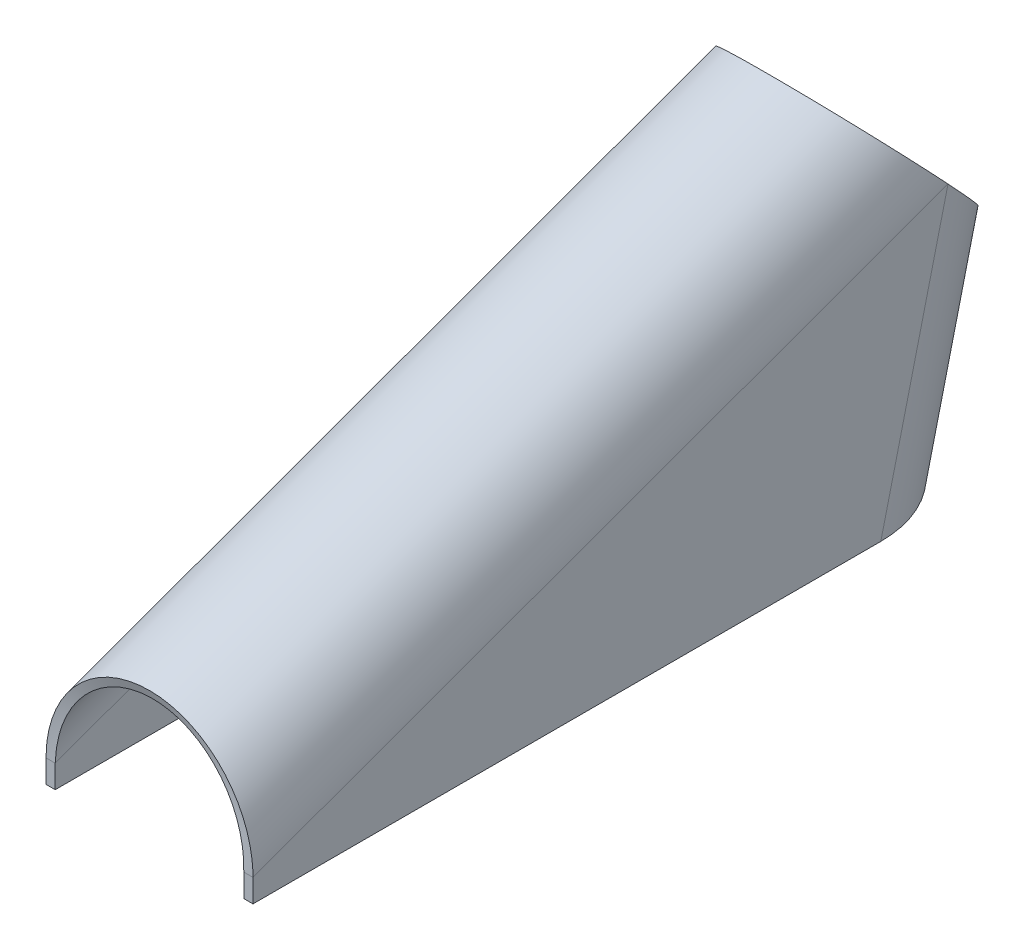
ISO-10303-21;
HEADER;
FILE_DESCRIPTION(('STEP AP214'),'2;1');
FILE_NAME('part.step','',(''),(''),'','','');
FILE_SCHEMA(('AUTOMOTIVE_DESIGN { 1 0 10303 214 1 1 1 1 }'));
ENDSEC;
DATA;
#1=APPLICATION_CONTEXT('core data for automotive mechanical design processes');
#2=APPLICATION_PROTOCOL_DEFINITION('international standard','automotive_design',2000,#1);
#3=PRODUCT_CONTEXT('',#1,'mechanical');
#4=PRODUCT('Part','Part','',(#3));
#5=PRODUCT_RELATED_PRODUCT_CATEGORY('part','',(#4));
#6=PRODUCT_DEFINITION_FORMATION('','',#4);
#7=PRODUCT_DEFINITION_CONTEXT('part definition',#1,'design');
#8=PRODUCT_DEFINITION('design','',#6,#7);
#9=PRODUCT_DEFINITION_SHAPE('','',#8);
#10=(LENGTH_UNIT() NAMED_UNIT(*) SI_UNIT(.MILLI.,.METRE.));
#11=(NAMED_UNIT(*) PLANE_ANGLE_UNIT() SI_UNIT($,.RADIAN.));
#12=(NAMED_UNIT(*) SI_UNIT($,.STERADIAN.) SOLID_ANGLE_UNIT());
#13=UNCERTAINTY_MEASURE_WITH_UNIT(LENGTH_MEASURE(1.E-05),#10,'distance_accuracy_value','');
#14=(GEOMETRIC_REPRESENTATION_CONTEXT(3) GLOBAL_UNCERTAINTY_ASSIGNED_CONTEXT((#13)) GLOBAL_UNIT_ASSIGNED_CONTEXT((#10,
#11,#12)) REPRESENTATION_CONTEXT('',''));
#15=CARTESIAN_POINT('',(0.,0.,0.));
#16=DIRECTION('',(0.,0.,1.));
#17=DIRECTION('',(1.,0.,0.));
#18=AXIS2_PLACEMENT_3D('',#15,#16,#17);
#19=CARTESIAN_POINT('',(0.,0.,-273.));
#20=DIRECTION('',(0.,-0.971605599894493,0.236606336038707));
#21=DIRECTION('',(0.00872653549837691,-0.236597326794433,-0.971568604130416));
#22=AXIS2_PLACEMENT_3D('',#19,#20,#21);
#23=CYLINDRICAL_SURFACE('',#22,45.);
#24=DIRECTION('',(0.,-0.971605599894494,0.236606336038707));
#25=VECTOR('',#24,1.);
#26=CARTESIAN_POINT('',(0.392694097426894,-73.4063149166926,-301.437348782619));
#27=LINE('',#26,#25);
#28=CARTESIAN_POINT('',(0.392694097426988,80.7136572999538,-338.968793579281));
#29=VERTEX_POINT('',#28);
#30=CARTESIAN_POINT('',(0.392694097426989,0.,-319.313325636219));
#31=VERTEX_POINT('',#30);
#32=EDGE_CURVE('E221',#29,#31,#27,.T.);
#33=ORIENTED_EDGE('',*,*,#32,.F.);
#34=CARTESIAN_POINT('',(0.,120.,-302.222516140014));
#35=DIRECTION('',(0.,-0.683102972547208,0.730322072032038));
#36=DIRECTION('',(0.,-0.730322072032038,-0.683102972547208));
#37=AXIS2_PLACEMENT_3D('',#34,#35,#36);
#38=ELLIPSE('',#37,53.795222909317,45.);
#39=CARTESIAN_POINT('',(45.0000000000001,120.,-302.222516140014));
#40=VERTEX_POINT('',#39);
#41=EDGE_CURVE('E407',#40,#29,#38,.F.);
#42=ORIENTED_EDGE('',*,*,#41,.F.);
#43=DIRECTION('',(0.,0.971605599894494,-0.236606336038707));
#44=VECTOR('',#43,1.);
#45=CARTESIAN_POINT('',(45.,123.708428844786,-303.125596321438));
#46=LINE('',#45,#44);
#47=CARTESIAN_POINT('',(45.0000000000001,0.,-273.));
#48=VERTEX_POINT('',#47);
#49=EDGE_CURVE('E261',#48,#40,#46,.T.);
#50=ORIENTED_EDGE('',*,*,#49,.F.);
#51=CARTESIAN_POINT('',(0.,0.,-273.));
#52=DIRECTION('',(0.,-1.,0.));
#53=DIRECTION('',(0.,0.,1.));
#54=AXIS2_PLACEMENT_3D('',#51,#52,#53);
#55=ELLIPSE('',#54,46.3150891728975,45.);
#56=EDGE_CURVE('E341',#48,#31,#55,.F.);
#57=ORIENTED_EDGE('',*,*,#56,.T.);
#58=EDGE_LOOP('',(#33,#42,#50,#57));
#59=FACE_BOUND('',#58,.T.);
#60=ADVANCED_FACE('F79',(#59),#23,.T.);
#61=CARTESIAN_POINT('',(0.,0.,-273.));
#62=DIRECTION('',(0.,-0.971605599894493,0.236606336038707));
#63=DIRECTION('',(0.00872653549837691,-0.236597326794433,-0.971568604130416));
#64=AXIS2_PLACEMENT_3D('',#61,#62,#63);
#65=CYLINDRICAL_SURFACE('',#64,41.);
#66=CARTESIAN_POINT('',(0.,120.,-302.222516140014));
#67=DIRECTION('',(0.,-0.650759245116275,0.759284139763038));
#68=DIRECTION('',(0.,-0.759284139763037,-0.650759245116275));
#69=AXIS2_PLACEMENT_3D('',#66,#67,#68);
#70=ELLIPSE('',#69,50.4967920551702,41.);
#71=CARTESIAN_POINT('',(41.,120.,-302.222516140014));
#72=VERTEX_POINT('',#71);
#73=CARTESIAN_POINT('',(0.357787955433481,81.6600466071315,-335.08251916276));
#74=VERTEX_POINT('',#73);
#75=EDGE_CURVE('E408',#72,#74,#70,.F.);
#76=ORIENTED_EDGE('',*,*,#75,.T.);
#77=DIRECTION('',(0.,0.971605599894494,-0.236606336038707));
#78=VECTOR('',#77,1.);
#79=CARTESIAN_POINT('',(0.357787955433481,110.299509601428,-342.056828909361));
#80=LINE('',#79,#78);
#81=CARTESIAN_POINT('',(0.357787955433476,0.946389307177714,-315.427051219697));
#82=VERTEX_POINT('',#81);
#83=EDGE_CURVE('E228',#74,#82,#80,.F.);
#84=ORIENTED_EDGE('',*,*,#83,.T.);
#85=CARTESIAN_POINT('',(0.,0.,-273.));
#86=DIRECTION('',(0.,-0.999751307936825,-0.0223007237238562));
#87=DIRECTION('',(0.,-0.0223007237238562,0.999751307936825));
#88=AXIS2_PLACEMENT_3D('',#85,#86,#87);
#89=ELLIPSE('',#88,42.4392210707671,41.);
#90=CARTESIAN_POINT('',(41.,0.,-273.));
#91=VERTEX_POINT('',#90);
#92=EDGE_CURVE('E338',#91,#82,#89,.F.);
#93=ORIENTED_EDGE('',*,*,#92,.F.);
#94=DIRECTION('',(0.,0.971605599894494,-0.236606336038707));
#95=VECTOR('',#94,1.);
#96=CARTESIAN_POINT('',(41.,123.708428844786,-303.125596321438));
#97=LINE('',#96,#95);
#98=EDGE_CURVE('E271',#91,#72,#97,.T.);
#99=ORIENTED_EDGE('',*,*,#98,.T.);
#100=EDGE_LOOP('',(#76,#84,#93,#99));
#101=FACE_BOUND('',#100,.T.);
#102=ADVANCED_FACE('F344',(#101),#65,.F.);
#103=CARTESIAN_POINT('',(2.35263921155085,-73.4022679588851,-301.420730263715));
#104=DIRECTION('',(0.00872653549837691,-0.236597326794433,-0.971568604130416));
#105=DIRECTION('',(0.,0.971605599894494,-0.236606336038707));
#106=AXIS2_PLACEMENT_3D('',#103,#104,#105);
#107=PLANE('',#106);
#108=DIRECTION('',(0.,-0.971605599894494,0.236606336038707));
#109=VECTOR('',#108,1.);
#110=CARTESIAN_POINT('',(0.201705846725105,-10.6472740644418,-316.722206589306));
#111=LINE('',#110,#109);
#112=CARTESIAN_POINT('',(0.201705846725119,80.7122021402106,-338.97015465542));
#113=VERTEX_POINT('',#112);
#114=CARTESIAN_POINT('',(0.201705846725106,0.,-319.315041074267));
#115=VERTEX_POINT('',#114);
#116=EDGE_CURVE('E209',#113,#115,#111,.T.);
#117=ORIENTED_EDGE('',*,*,#116,.F.);
#118=DIRECTION('',(-0.999945585612641,-0.00761869149490946,-0.00712610368273859));
#119=VECTOR('',#118,1.);
#120=CARTESIAN_POINT('',(1.44588495375754,80.7216816728148,-338.961288023631));
#121=LINE('',#120,#119);
#122=EDGE_CURVE('E196',#29,#113,#121,.T.);
#123=ORIENTED_EDGE('',*,*,#122,.F.);
#124=ORIENTED_EDGE('',*,*,#32,.T.);
#125=DIRECTION('',(-0.999959665144756,0.,-0.00898154127020295));
#126=VECTOR('',#125,1.);
#127=CARTESIAN_POINT('',(2.51317770836812,0.,-319.294279656938));
#128=LINE('',#127,#126);
#129=EDGE_CURVE('E215',#31,#115,#128,.T.);
#130=ORIENTED_EDGE('',*,*,#129,.T.);
#131=EDGE_LOOP('',(#117,#123,#124,#130));
#132=FACE_BOUND('',#131,.T.);
#133=ADVANCED_FACE('F213',(#132),#107,.T.);
#134=CARTESIAN_POINT('',(2.31773306955734,-72.4558786517074,-297.534455847193));
#135=DIRECTION('',(0.00872653549837691,-0.236597326794433,-0.971568604130416));
#136=DIRECTION('',(0.,0.971605599894494,-0.236606336038707));
#137=AXIS2_PLACEMENT_3D('',#134,#135,#136);
#138=PLANE('',#137);
#139=DIRECTION('',(-0.999945585612641,-0.00761869149490946,-0.00712610368273859));
#140=VECTOR('',#139,1.);
#141=CARTESIAN_POINT('',(1.41097881176403,81.6680709799925,-335.075013607109));
#142=LINE('',#141,#140);
#143=CARTESIAN_POINT('',(0.166799704731608,81.6585914473884,-335.083880238898));
#144=VERTEX_POINT('',#143);
#145=EDGE_CURVE('E414',#74,#144,#142,.T.);
#146=ORIENTED_EDGE('',*,*,#145,.T.);
#147=DIRECTION('',(0.,0.971605599894494,-0.236606336038707));
#148=VECTOR('',#147,1.);
#149=CARTESIAN_POINT('',(0.166799704731588,-72.4603199682072,-297.552693769535));
#150=LINE('',#149,#148);
#151=CARTESIAN_POINT('',(0.166799704731596,0.946389307177761,-315.428766657745));
#152=VERTEX_POINT('',#151);
#153=EDGE_CURVE('E96',#144,#152,#150,.F.);
#154=ORIENTED_EDGE('',*,*,#153,.T.);
#155=DIRECTION('',(-0.999959665144756,0.,-0.00898154127020295));
#156=VECTOR('',#155,1.);
#157=CARTESIAN_POINT('',(2.47827156637461,0.94638930717772,-315.408005240416));
#158=LINE('',#157,#156);
#159=EDGE_CURVE('E347',#82,#152,#158,.T.);
#160=ORIENTED_EDGE('',*,*,#159,.F.);
#161=ORIENTED_EDGE('',*,*,#83,.F.);
#162=EDGE_LOOP('',(#146,#154,#160,#161));
#163=FACE_BOUND('',#162,.T.);
#164=ADVANCED_FACE('F621',(#163),#138,.F.);
#165=CARTESIAN_POINT('',(0.201705846725105,-10.6472740644418,-316.722206589306));
#166=DIRECTION('',(-0.999961923064171,-0.00206475359058271,-0.00847875075790174));
#167=DIRECTION('',(-0.00847876883129597,0.,0.999964054593517));
#168=AXIS2_PLACEMENT_3D('',#165,#166,#167);
#169=PLANE('',#168);
#170=ORIENTED_EDGE('',*,*,#153,.F.);
#171=DIRECTION('',(0.00872653549837691,-0.236597326794433,-0.971568604130416));
#172=VECTOR('',#171,1.);
#173=CARTESIAN_POINT('',(0.201705846725119,80.7122021402106,-338.97015465542));
#174=LINE('',#173,#172);
#175=EDGE_CURVE('E199',#113,#144,#174,.F.);
#176=ORIENTED_EDGE('',*,*,#175,.F.);
#177=ORIENTED_EDGE('',*,*,#116,.T.);
#178=DIRECTION('',(0.00872653549837691,-0.236597326794433,-0.971568604130416));
#179=VECTOR('',#178,1.);
#180=CARTESIAN_POINT('',(0.201705846725106,0.,-319.315041074267));
#181=LINE('',#180,#179);
#182=EDGE_CURVE('E355',#115,#152,#181,.F.);
#183=ORIENTED_EDGE('',*,*,#182,.T.);
#184=EDGE_LOOP('',(#170,#176,#177,#183));
#185=FACE_BOUND('',#184,.T.);
#186=ADVANCED_FACE('F207',(#185),#169,.T.);
#187=CARTESIAN_POINT('',(0.,120.,-302.222516140014));
#188=DIRECTION('',(0.,0.971605599894494,-0.236606336038707));
#189=DIRECTION('',(-0.00872653549837747,-0.236597326794433,-0.971568604130416));
#190=AXIS2_PLACEMENT_3D('',#187,#188,#189);
#191=CYLINDRICAL_SURFACE('',#190,45.);
#192=DIRECTION('',(0.,0.971605599894494,-0.236606336038707));
#193=VECTOR('',#192,1.);
#194=CARTESIAN_POINT('',(-0.392694097426992,-73.4063149166926,-301.437348782619));
#195=LINE('',#194,#193);
#196=CARTESIAN_POINT('',(-0.39269409742699,0.,-319.313325636219));
#197=VERTEX_POINT('',#196);
#198=CARTESIAN_POINT('',(-0.392694097426989,80.7136572999538,-338.968793579281));
#199=VERTEX_POINT('',#198);
#200=EDGE_CURVE('E360',#197,#199,#195,.T.);
#201=ORIENTED_EDGE('',*,*,#200,.F.);
#202=CARTESIAN_POINT('',(0.,0.,-273.));
#203=DIRECTION('',(0.,-1.,0.));
#204=DIRECTION('',(0.,0.,-1.));
#205=AXIS2_PLACEMENT_3D('',#202,#203,#204);
#206=ELLIPSE('',#205,46.3150891728974,45.);
#207=CARTESIAN_POINT('',(-45.,0.,-273.));
#208=VERTEX_POINT('',#207);
#209=EDGE_CURVE('E410',#197,#208,#206,.F.);
#210=ORIENTED_EDGE('',*,*,#209,.T.);
#211=DIRECTION('',(0.,-0.971605599894494,0.236606336038707));
#212=VECTOR('',#211,1.);
#213=CARTESIAN_POINT('',(-45.,123.708428844786,-303.125596321438));
#214=LINE('',#213,#212);
#215=CARTESIAN_POINT('',(-45.,120.,-302.222516140014));
#216=VERTEX_POINT('',#215);
#217=EDGE_CURVE('E238',#216,#208,#214,.T.);
#218=ORIENTED_EDGE('',*,*,#217,.F.);
#219=CARTESIAN_POINT('',(0.,120.,-302.222516140014));
#220=DIRECTION('',(0.,-0.683102972547208,0.730322072032038));
#221=DIRECTION('',(0.,0.730322072032038,0.683102972547208));
#222=AXIS2_PLACEMENT_3D('',#219,#220,#221);
#223=ELLIPSE('',#222,53.7952229093169,45.);
#224=EDGE_CURVE('E383',#199,#216,#223,.F.);
#225=ORIENTED_EDGE('',*,*,#224,.F.);
#226=EDGE_LOOP('',(#201,#210,#218,#225));
#227=FACE_BOUND('',#226,.T.);
#228=ADVANCED_FACE('F434',(#227),#191,.T.);
#229=CARTESIAN_POINT('',(0.,120.,-302.222516140014));
#230=DIRECTION('',(0.,0.971605599894494,-0.236606336038707));
#231=DIRECTION('',(-0.00872653549837747,-0.236597326794433,-0.971568604130416));
#232=AXIS2_PLACEMENT_3D('',#229,#230,#231);
#233=CYLINDRICAL_SURFACE('',#232,41.);
#234=CARTESIAN_POINT('',(0.,0.,-273.));
#235=DIRECTION('',(0.,-0.999751307936825,-0.0223007237238562));
#236=DIRECTION('',(0.,0.0223007237238562,-0.999751307936825));
#237=AXIS2_PLACEMENT_3D('',#234,#235,#236);
#238=ELLIPSE('',#237,42.4392210707671,41.);
#239=CARTESIAN_POINT('',(-0.35778795543348,0.946389307177695,-315.427051219697));
#240=VERTEX_POINT('',#239);
#241=CARTESIAN_POINT('',(-41.,0.,-273.));
#242=VERTEX_POINT('',#241);
#243=EDGE_CURVE('E373',#240,#242,#238,.F.);
#244=ORIENTED_EDGE('',*,*,#243,.F.);
#245=DIRECTION('',(0.,-0.971605599894494,0.236606336038707));
#246=VECTOR('',#245,1.);
#247=CARTESIAN_POINT('',(-0.357787955433479,-9.70049039857174,-312.834312769347));
#248=LINE('',#247,#246);
#249=CARTESIAN_POINT('',(-0.357787955433478,81.6600466071315,-335.08251916276));
#250=VERTEX_POINT('',#249);
#251=EDGE_CURVE('E224',#240,#250,#248,.F.);
#252=ORIENTED_EDGE('',*,*,#251,.T.);
#253=CARTESIAN_POINT('',(0.,120.,-302.222516140014));
#254=DIRECTION('',(0.,-0.650759245116276,0.759284139763037));
#255=DIRECTION('',(0.,0.759284139763037,0.650759245116275));
#256=AXIS2_PLACEMENT_3D('',#253,#254,#255);
#257=ELLIPSE('',#256,50.4967920551701,41.);
#258=CARTESIAN_POINT('',(-41.,120.,-302.222516140014));
#259=VERTEX_POINT('',#258);
#260=EDGE_CURVE('E372',#250,#259,#257,.F.);
#261=ORIENTED_EDGE('',*,*,#260,.T.);
#262=DIRECTION('',(0.,-0.971605599894494,0.236606336038707));
#263=VECTOR('',#262,1.);
#264=CARTESIAN_POINT('',(-41.,123.708428844786,-303.125596321438));
#265=LINE('',#264,#263);
#266=EDGE_CURVE('E237',#259,#242,#265,.T.);
#267=ORIENTED_EDGE('',*,*,#266,.T.);
#268=EDGE_LOOP('',(#244,#252,#261,#267));
#269=FACE_BOUND('',#268,.T.);
#270=ADVANCED_FACE('F371',(#269),#233,.F.);
#271=CARTESIAN_POINT('',(-2.35263921155099,-73.4022679588851,-301.420730263715));
#272=DIRECTION('',(-0.00872653549837747,-0.236597326794433,-0.971568604130415));
#273=DIRECTION('',(0.,0.971605599894493,-0.236606336038707));
#274=AXIS2_PLACEMENT_3D('',#271,#272,#273);
#275=PLANE('',#274);
#276=DIRECTION('',(0.,0.971605599894494,-0.236606336038707));
#277=VECTOR('',#276,1.);
#278=CARTESIAN_POINT('',(-0.201705846725125,109.352725935558,-345.94472272932));
#279=LINE('',#278,#277);
#280=CARTESIAN_POINT('',(-0.201705846725126,0.,-319.315041074267));
#281=VERTEX_POINT('',#280);
#282=CARTESIAN_POINT('',(-0.201705846725125,80.712202140211,-338.97015465542));
#283=VERTEX_POINT('',#282);
#284=EDGE_CURVE('E230',#281,#283,#279,.T.);
#285=ORIENTED_EDGE('',*,*,#284,.F.);
#286=DIRECTION('',(-0.999959665144755,0.,0.00898154127020353));
#287=VECTOR('',#286,1.);
#288=CARTESIAN_POINT('',(-2.51317770836828,0.,-319.294279656938));
#289=LINE('',#288,#287);
#290=EDGE_CURVE('E418',#281,#197,#289,.T.);
#291=ORIENTED_EDGE('',*,*,#290,.T.);
#292=ORIENTED_EDGE('',*,*,#200,.T.);
#293=DIRECTION('',(-0.999945585612641,0.00761869149490995,0.00712610368273905));
#294=VECTOR('',#293,1.);
#295=CARTESIAN_POINT('',(-1.44588495375763,80.7216816728148,-338.961288023631));
#296=LINE('',#295,#294);
#297=EDGE_CURVE('E391',#283,#199,#296,.T.);
#298=ORIENTED_EDGE('',*,*,#297,.F.);
#299=EDGE_LOOP('',(#285,#291,#292,#298));
#300=FACE_BOUND('',#299,.T.);
#301=ADVANCED_FACE('F432',(#300),#275,.T.);
#302=CARTESIAN_POINT('',(-2.31773306955748,-72.4558786517074,-297.534455847193));
#303=DIRECTION('',(-0.00872653549837747,-0.236597326794433,-0.971568604130415));
#304=DIRECTION('',(0.,0.971605599894493,-0.236606336038707));
#305=AXIS2_PLACEMENT_3D('',#302,#303,#304);
#306=PLANE('',#305);
#307=DIRECTION('',(-0.999959665144755,0.,0.00898154127020353));
#308=VECTOR('',#307,1.);
#309=CARTESIAN_POINT('',(-2.47827156637477,0.946389307177733,-315.408005240416));
#310=LINE('',#309,#308);
#311=CARTESIAN_POINT('',(-0.166799704731617,0.94638930717773,-315.428766657745));
#312=VERTEX_POINT('',#311);
#313=EDGE_CURVE('E420',#312,#240,#310,.T.);
#314=ORIENTED_EDGE('',*,*,#313,.F.);
#315=DIRECTION('',(0.,-0.971605599894494,0.236606336038707));
#316=VECTOR('',#315,1.);
#317=CARTESIAN_POINT('',(-0.166799704731615,-72.4603199682072,-297.552693769535));
#318=LINE('',#317,#316);
#319=CARTESIAN_POINT('',(-0.166799704731617,81.6585914473887,-335.083880238898));
#320=VERTEX_POINT('',#319);
#321=EDGE_CURVE('E359',#312,#320,#318,.F.);
#322=ORIENTED_EDGE('',*,*,#321,.T.);
#323=DIRECTION('',(-0.999945585612641,0.00761869149490995,0.00712610368273905));
#324=VECTOR('',#323,1.);
#325=CARTESIAN_POINT('',(-1.41097881176412,81.6680709799925,-335.075013607109));
#326=LINE('',#325,#324);
#327=EDGE_CURVE('E389',#320,#250,#326,.T.);
#328=ORIENTED_EDGE('',*,*,#327,.T.);
#329=ORIENTED_EDGE('',*,*,#251,.F.);
#330=EDGE_LOOP('',(#314,#322,#328,#329));
#331=FACE_BOUND('',#330,.T.);
#332=ADVANCED_FACE('F393',(#331),#306,.F.);
#333=CARTESIAN_POINT('',(-0.201705846725126,109.352725935558,-345.94472272932));
#334=DIRECTION('',(0.999961923064171,-0.00206475359058282,-0.00847875075790171));
#335=DIRECTION('',(-0.00847876883129594,0.,-0.999964054593517));
#336=AXIS2_PLACEMENT_3D('',#333,#334,#335);
#337=PLANE('',#336);
#338=ORIENTED_EDGE('',*,*,#321,.F.);
#339=DIRECTION('',(-0.00872653549837747,-0.236597326794433,-0.971568604130415));
#340=VECTOR('',#339,1.);
#341=CARTESIAN_POINT('',(-0.201705846725126,0.,-319.315041074267));
#342=LINE('',#341,#340);
#343=EDGE_CURVE('E422',#281,#312,#342,.F.);
#344=ORIENTED_EDGE('',*,*,#343,.F.);
#345=ORIENTED_EDGE('',*,*,#284,.T.);
#346=DIRECTION('',(-0.00872653549837747,-0.236597326794433,-0.971568604130415));
#347=VECTOR('',#346,1.);
#348=CARTESIAN_POINT('',(-0.201705846725125,80.712202140211,-338.97015465542));
#349=LINE('',#348,#347);
#350=EDGE_CURVE('E395',#283,#320,#349,.F.);
#351=ORIENTED_EDGE('',*,*,#350,.T.);
#352=EDGE_LOOP('',(#338,#344,#345,#351));
#353=FACE_BOUND('',#352,.T.);
#354=ADVANCED_FACE('F431',(#353),#337,.T.);
#355=CARTESIAN_POINT('',(0.,122.35361708248,-308.689025928172));
#356=DIRECTION('',(0.,-0.342020143325663,0.939692620785911));
#357=DIRECTION('',(0.,-0.939692620785911,-0.342020143325663));
#358=AXIS2_PLACEMENT_3D('',#355,#356,#357);
#359=CYLINDRICAL_SURFACE('',#358,45.);
#360=CARTESIAN_POINT('',(0.,120.,-302.222516140014));
#361=DIRECTION('',(0.,-0.683102972547208,0.730322072032038));
#362=DIRECTION('',(0.,0.730322072032038,0.683102972547208));
#363=AXIS2_PLACEMENT_3D('',#360,#361,#362);
#364=ELLIPSE('',#363,48.917656707732,45.);
#365=EDGE_CURVE('E298',#40,#216,#364,.T.);
#366=ORIENTED_EDGE('',*,*,#365,.T.);
#367=DIRECTION('',(0.,-0.342020143325663,0.939692620785911));
#368=VECTOR('',#367,1.);
#369=CARTESIAN_POINT('',(-45.,122.35361708248,-308.689025928172));
#370=LINE('',#369,#368);
#371=CARTESIAN_POINT('',(-45.,10.,0.));
#372=VERTEX_POINT('',#371);
#373=EDGE_CURVE('E286',#216,#372,#370,.T.);
#374=ORIENTED_EDGE('',*,*,#373,.T.);
#375=CARTESIAN_POINT('',(0.,10.,0.));
#376=DIRECTION('',(0.,0.,-1.));
#377=DIRECTION('',(0.,-1.,0.));
#378=AXIS2_PLACEMENT_3D('',#375,#376,#377);
#379=ELLIPSE('',#378,47.8879997614159,45.);
#380=CARTESIAN_POINT('',(45.,10.,-1.11022302462516E-13));
#381=VERTEX_POINT('',#380);
#382=EDGE_CURVE('E216',#372,#381,#379,.T.);
#383=ORIENTED_EDGE('',*,*,#382,.T.);
#384=DIRECTION('',(0.,-0.342020143325663,0.939692620785911));
#385=VECTOR('',#384,1.);
#386=CARTESIAN_POINT('',(45.,122.35361708248,-308.689025928172));
#387=LINE('',#386,#385);
#388=EDGE_CURVE('E83',#40,#381,#387,.T.);
#389=ORIENTED_EDGE('',*,*,#388,.F.);
#390=EDGE_LOOP('',(#366,#374,#383,#389));
#391=FACE_BOUND('',#390,.T.);
#392=ADVANCED_FACE('F296',(#391),#359,.T.);
#393=CARTESIAN_POINT('',(0.,122.35361708248,-308.689025928172));
#394=DIRECTION('',(0.,-0.342020143325663,0.939692620785911));
#395=DIRECTION('',(0.,-0.939692620785911,-0.342020143325663));
#396=AXIS2_PLACEMENT_3D('',#393,#394,#395);
#397=CYLINDRICAL_SURFACE('',#396,41.);
#398=DIRECTION('',(0.,-0.342020143325663,0.939692620785911));
#399=VECTOR('',#398,1.);
#400=CARTESIAN_POINT('',(-41.,122.35361708248,-308.689025928172));
#401=LINE('',#400,#399);
#402=CARTESIAN_POINT('',(-41.,10.,0.));
#403=VERTEX_POINT('',#402);
#404=EDGE_CURVE('E88',#259,#403,#401,.T.);
#405=ORIENTED_EDGE('',*,*,#404,.F.);
#406=CARTESIAN_POINT('',(0.,120.,-302.222516140014));
#407=DIRECTION('',(0.,-0.707999201722316,0.706213232926545));
#408=DIRECTION('',(0.,0.706213232926545,0.707999201722316));
#409=AXIS2_PLACEMENT_3D('',#406,#407,#408);
#410=ELLIPSE('',#409,45.2651868191828,41.);
#411=EDGE_CURVE('E322',#72,#259,#410,.T.);
#412=ORIENTED_EDGE('',*,*,#411,.F.);
#413=DIRECTION('',(0.,-0.342020143325663,0.939692620785911));
#414=VECTOR('',#413,1.);
#415=CARTESIAN_POINT('',(41.,122.35361708248,-308.689025928172));
#416=LINE('',#415,#414);
#417=CARTESIAN_POINT('',(41.,10.,-1.11022302462516E-13));
#418=VERTEX_POINT('',#417);
#419=EDGE_CURVE('E13',#72,#418,#416,.T.);
#420=ORIENTED_EDGE('',*,*,#419,.T.);
#421=CARTESIAN_POINT('',(0.,10.,0.));
#422=DIRECTION('',(0.,-0.03098680024333,-0.999519793806346));
#423=DIRECTION('',(0.,-0.999519793806346,0.03098680024333));
#424=AXIS2_PLACEMENT_3D('',#421,#422,#423);
#425=ELLIPSE('',#424,44.1504305884934,41.);
#426=EDGE_CURVE('E219',#403,#418,#425,.T.);
#427=ORIENTED_EDGE('',*,*,#426,.F.);
#428=EDGE_LOOP('',(#405,#412,#420,#427));
#429=FACE_BOUND('',#428,.T.);
#430=ADVANCED_FACE('F320',(#429),#397,.F.);
#431=CARTESIAN_POINT('',(45.,122.35361708248,-308.689025928172));
#432=DIRECTION('',(-1.,0.,0.));
#433=DIRECTION('',(0.,0.,1.));
#434=AXIS2_PLACEMENT_3D('',#431,#432,#433);
#435=PLANE('',#434);
#436=DIRECTION('',(0.,1.,0.));
#437=VECTOR('',#436,1.);
#438=CARTESIAN_POINT('',(45.,122.35361708248,-1.11022302462516E-13));
#439=LINE('',#438,#437);
#440=CARTESIAN_POINT('',(45.,0.,0.));
#441=VERTEX_POINT('',#440);
#442=EDGE_CURVE('E263',#381,#441,#439,.F.);
#443=ORIENTED_EDGE('',*,*,#442,.T.);
#444=DIRECTION('',(0.,0.,1.));
#445=VECTOR('',#444,1.);
#446=CARTESIAN_POINT('',(45.,0.,-308.689025928172));
#447=LINE('',#446,#445);
#448=EDGE_CURVE('E258',#441,#48,#447,.F.);
#449=ORIENTED_EDGE('',*,*,#448,.T.);
#450=ORIENTED_EDGE('',*,*,#49,.T.);
#451=ORIENTED_EDGE('',*,*,#388,.T.);
#452=EDGE_LOOP('',(#443,#449,#450,#451));
#453=FACE_BOUND('',#452,.T.);
#454=ADVANCED_FACE('F294',(#453),#435,.F.);
#455=CARTESIAN_POINT('',(-45.,122.35361708248,-308.689025928172));
#456=DIRECTION('',(1.,0.,0.));
#457=DIRECTION('',(0.,0.,-1.));
#458=AXIS2_PLACEMENT_3D('',#455,#456,#457);
#459=PLANE('',#458);
#460=ORIENTED_EDGE('',*,*,#217,.T.);
#461=DIRECTION('',(0.,0.,-1.));
#462=VECTOR('',#461,1.);
#463=CARTESIAN_POINT('',(-45.,0.,-308.689025928172));
#464=LINE('',#463,#462);
#465=CARTESIAN_POINT('',(-45.,0.,0.));
#466=VERTEX_POINT('',#465);
#467=EDGE_CURVE('E233',#208,#466,#464,.F.);
#468=ORIENTED_EDGE('',*,*,#467,.T.);
#469=DIRECTION('',(0.,1.,0.));
#470=VECTOR('',#469,1.);
#471=CARTESIAN_POINT('',(-45.,122.35361708248,0.));
#472=LINE('',#471,#470);
#473=EDGE_CURVE('E236',#466,#372,#472,.T.);
#474=ORIENTED_EDGE('',*,*,#473,.T.);
#475=ORIENTED_EDGE('',*,*,#373,.F.);
#476=EDGE_LOOP('',(#460,#468,#474,#475));
#477=FACE_BOUND('',#476,.T.);
#478=ADVANCED_FACE('F308',(#477),#459,.F.);
#479=CARTESIAN_POINT('',(41.,122.35361708248,0.));
#480=DIRECTION('',(0.,0.,-1.));
#481=DIRECTION('',(0.,-1.,0.));
#482=AXIS2_PLACEMENT_3D('',#479,#480,#481);
#483=PLANE('',#482);
#484=DIRECTION('',(-1.,0.,0.));
#485=VECTOR('',#484,1.);
#486=CARTESIAN_POINT('',(41.,10.,-1.11022302462516E-13));
#487=LINE('',#486,#485);
#488=EDGE_CURVE('E278',#418,#381,#487,.F.);
#489=ORIENTED_EDGE('',*,*,#488,.F.);
#490=DIRECTION('',(0.,-1.,0.));
#491=VECTOR('',#490,1.);
#492=CARTESIAN_POINT('',(41.,122.35361708248,0.));
#493=LINE('',#492,#491);
#494=CARTESIAN_POINT('',(41.,0.,0.));
#495=VERTEX_POINT('',#494);
#496=EDGE_CURVE('E262',#418,#495,#493,.T.);
#497=ORIENTED_EDGE('',*,*,#496,.T.);
#498=DIRECTION('',(-1.,0.,0.));
#499=VECTOR('',#498,1.);
#500=CARTESIAN_POINT('',(41.,0.,0.));
#501=LINE('',#500,#499);
#502=EDGE_CURVE('E275',#495,#441,#501,.F.);
#503=ORIENTED_EDGE('',*,*,#502,.T.);
#504=ORIENTED_EDGE('',*,*,#442,.F.);
#505=EDGE_LOOP('',(#489,#497,#503,#504));
#506=FACE_BOUND('',#505,.T.);
#507=ADVANCED_FACE('F326',(#506),#483,.F.);
#508=CARTESIAN_POINT('',(41.,0.,-308.689025928172));
#509=DIRECTION('',(0.,1.,0.));
#510=DIRECTION('',(0.,0.,-1.));
#511=AXIS2_PLACEMENT_3D('',#508,#509,#510);
#512=PLANE('',#511);
#513=ORIENTED_EDGE('',*,*,#502,.F.);
#514=DIRECTION('',(0.,0.,-1.));
#515=VECTOR('',#514,1.);
#516=CARTESIAN_POINT('',(41.,0.,-308.689025928172));
#517=LINE('',#516,#515);
#518=EDGE_CURVE('E256',#495,#91,#517,.T.);
#519=ORIENTED_EDGE('',*,*,#518,.T.);
#520=DIRECTION('',(-1.,0.,0.));
#521=VECTOR('',#520,1.);
#522=CARTESIAN_POINT('',(41.,0.,-273.));
#523=LINE('',#522,#521);
#524=EDGE_CURVE('E266',#91,#48,#523,.F.);
#525=ORIENTED_EDGE('',*,*,#524,.T.);
#526=ORIENTED_EDGE('',*,*,#448,.F.);
#527=EDGE_LOOP('',(#513,#519,#525,#526));
#528=FACE_BOUND('',#527,.T.);
#529=ADVANCED_FACE('F332',(#528),#512,.F.);
#530=CARTESIAN_POINT('',(-41.,0.,-308.689025928172));
#531=DIRECTION('',(0.,1.,0.));
#532=DIRECTION('',(0.,0.,1.));
#533=AXIS2_PLACEMENT_3D('',#530,#531,#532);
#534=PLANE('',#533);
#535=DIRECTION('',(1.,0.,0.));
#536=VECTOR('',#535,1.);
#537=CARTESIAN_POINT('',(-41.,0.,-273.));
#538=LINE('',#537,#536);
#539=EDGE_CURVE('E248',#242,#208,#538,.F.);
#540=ORIENTED_EDGE('',*,*,#539,.F.);
#541=DIRECTION('',(0.,0.,1.));
#542=VECTOR('',#541,1.);
#543=CARTESIAN_POINT('',(-41.,0.,-308.689025928172));
#544=LINE('',#543,#542);
#545=CARTESIAN_POINT('',(-41.,0.,0.));
#546=VERTEX_POINT('',#545);
#547=EDGE_CURVE('E231',#242,#546,#544,.T.);
#548=ORIENTED_EDGE('',*,*,#547,.T.);
#549=DIRECTION('',(1.,0.,0.));
#550=VECTOR('',#549,1.);
#551=CARTESIAN_POINT('',(-41.,0.,0.));
#552=LINE('',#551,#550);
#553=EDGE_CURVE('E104',#546,#466,#552,.F.);
#554=ORIENTED_EDGE('',*,*,#553,.T.);
#555=ORIENTED_EDGE('',*,*,#467,.F.);
#556=EDGE_LOOP('',(#540,#548,#554,#555));
#557=FACE_BOUND('',#556,.T.);
#558=ADVANCED_FACE('F312',(#557),#534,.F.);
#559=CARTESIAN_POINT('',(-41.,122.35361708248,0.));
#560=DIRECTION('',(0.,0.,-1.));
#561=DIRECTION('',(0.,1.,0.));
#562=AXIS2_PLACEMENT_3D('',#559,#560,#561);
#563=PLANE('',#562);
#564=DIRECTION('',(0.,1.,0.));
#565=VECTOR('',#564,1.);
#566=CARTESIAN_POINT('',(-41.,122.35361708248,0.));
#567=LINE('',#566,#565);
#568=EDGE_CURVE('E244',#546,#403,#567,.T.);
#569=ORIENTED_EDGE('',*,*,#568,.T.);
#570=DIRECTION('',(1.,0.,0.));
#571=VECTOR('',#570,1.);
#572=CARTESIAN_POINT('',(-41.,10.,0.));
#573=LINE('',#572,#571);
#574=EDGE_CURVE('E253',#403,#372,#573,.F.);
#575=ORIENTED_EDGE('',*,*,#574,.T.);
#576=ORIENTED_EDGE('',*,*,#473,.F.);
#577=ORIENTED_EDGE('',*,*,#553,.F.);
#578=EDGE_LOOP('',(#569,#575,#576,#577));
#579=FACE_BOUND('',#578,.T.);
#580=ADVANCED_FACE('F305',(#579),#563,.F.);
#581=CARTESIAN_POINT('',(0.,-34.1292292782723,1.36808057330259));
#582=CARTESIAN_POINT('',(0.,-35.3821527726535,0.912053715535045));
#583=CARTESIAN_POINT('',(0.,-36.6350762670347,0.456026857767495));
#584=CARTESIAN_POINT('',(0.,-37.8879997614159,0.));
#585=CARTESIAN_POINT('',(-81.9999999999999,-34.1292292782723,1.36808057330259));
#586=CARTESIAN_POINT('',(-84.6666666666666,-35.3821527726535,0.912053715535045));
#587=CARTESIAN_POINT('',(-87.3333333333333,-36.6350762670347,0.456026857767495));
#588=CARTESIAN_POINT('',(-90.,-37.8879997614159,0.));
#589=CARTESIAN_POINT('',(-81.9999999999999,54.1292292782723,-1.36808057330271));
#590=CARTESIAN_POINT('',(-84.6666666666666,55.3821527726535,-0.912053715535156));
#591=CARTESIAN_POINT('',(-87.3333333333333,56.6350762670347,-0.456026857767606));
#592=CARTESIAN_POINT('',(-90.,57.8879997614159,0.));
#593=CARTESIAN_POINT('',(0.,54.1292292782723,-1.36808057330271));
#594=CARTESIAN_POINT('',(0.,55.3821527726535,-0.912053715535156));
#595=CARTESIAN_POINT('',(0.,56.6350762670347,-0.456026857767606));
#596=CARTESIAN_POINT('',(0.,57.8879997614159,0.));
#597=CARTESIAN_POINT('',(81.9999999999999,54.1292292782723,-1.36808057330271));
#598=CARTESIAN_POINT('',(84.6666666666666,55.3821527726535,-0.912053715535156));
#599=CARTESIAN_POINT('',(87.3333333333333,56.6350762670347,-0.456026857767606));
#600=CARTESIAN_POINT('',(90.,57.887999761416,0.));
#601=CARTESIAN_POINT('',(81.9999999999999,-34.1292292782723,1.36808057330259));
#602=CARTESIAN_POINT('',(84.6666666666666,-35.3821527726535,0.912053715535045));
#603=CARTESIAN_POINT('',(87.3333333333333,-36.6350762670347,0.456026857767495));
#604=CARTESIAN_POINT('',(90.,-37.8879997614159,0.));
#605=CARTESIAN_POINT('',(0.,-34.1292292782723,1.36808057330259));
#606=CARTESIAN_POINT('',(0.,-35.3821527726535,0.912053715535045));
#607=CARTESIAN_POINT('',(0.,-36.6350762670347,0.456026857767495));
#608=CARTESIAN_POINT('',(0.,-37.8879997614159,0.));
#609=(BOUNDED_SURFACE() B_SPLINE_SURFACE(3,3,((#581,#582,#583,#584),(#585,#586,#587,#588),(#589,
#590,#591,#592),(#593,#594,#595,#596),(#597,#598,#599,#600),(#601,#602,#603,#604),(#605,#606,
#607,#608)),.UNSPECIFIED.,.T.,.F.,.F.) B_SPLINE_SURFACE_WITH_KNOTS((4,3,4),(4,4),(0.,0.5,1.),
(0.,1.),.UNSPECIFIED.) GEOMETRIC_REPRESENTATION_ITEM() RATIONAL_B_SPLINE_SURFACE(((1.,1.,1.,1.),
(0.333333333333333,0.333333333333333,0.333333333333333,0.333333333333333),(0.333333333333333,
0.333333333333333,0.333333333333333,0.333333333333333),(1.,1.,1.,1.),(0.333333333333333,
0.333333333333333,0.333333333333333,0.333333333333333),(0.333333333333333,0.333333333333333,
0.333333333333333,0.333333333333333),(1.,1.,1.,1.))) REPRESENTATION_ITEM('') SURFACE());
#610=ORIENTED_EDGE('',*,*,#488,.T.);
#611=ORIENTED_EDGE('',*,*,#382,.F.);
#612=ORIENTED_EDGE('',*,*,#574,.F.);
#613=ORIENTED_EDGE('',*,*,#426,.T.);
#614=EDGE_LOOP('',(#610,#611,#612,#613));
#615=FACE_BOUND('',#614,.T.);
#616=ADVANCED_FACE('F302',(#615),#609,.T.);
#617=CARTESIAN_POINT('',(41.,122.35361708248,-308.689025928172));
#618=DIRECTION('',(-1.,0.,0.));
#619=DIRECTION('',(0.,0.,1.));
#620=AXIS2_PLACEMENT_3D('',#617,#618,#619);
#621=PLANE('',#620);
#622=ORIENTED_EDGE('',*,*,#518,.F.);
#623=ORIENTED_EDGE('',*,*,#496,.F.);
#624=ORIENTED_EDGE('',*,*,#419,.F.);
#625=ORIENTED_EDGE('',*,*,#98,.F.);
#626=EDGE_LOOP('',(#622,#623,#624,#625));
#627=FACE_BOUND('',#626,.T.);
#628=ADVANCED_FACE('F81',(#627),#621,.T.);
#629=CARTESIAN_POINT('',(-41.,122.35361708248,-308.689025928172));
#630=DIRECTION('',(1.,0.,0.));
#631=DIRECTION('',(0.,0.,-1.));
#632=AXIS2_PLACEMENT_3D('',#629,#630,#631);
#633=PLANE('',#632);
#634=ORIENTED_EDGE('',*,*,#547,.F.);
#635=ORIENTED_EDGE('',*,*,#266,.F.);
#636=ORIENTED_EDGE('',*,*,#404,.T.);
#637=ORIENTED_EDGE('',*,*,#568,.F.);
#638=EDGE_LOOP('',(#634,#635,#636,#637));
#639=FACE_BOUND('',#638,.T.);
#640=ADVANCED_FACE('F316',(#639),#633,.T.);
#641=CARTESIAN_POINT('',(2.51317770836812,0.,-319.294279656938));
#642=DIRECTION('',(-0.00212500865502389,-0.971607793790132,0.236587783675505));
#643=DIRECTION('',(-0.999959665144756,0.,-0.00898154127020295));
#644=AXIS2_PLACEMENT_3D('',#641,#642,#643);
#645=PLANE('',#644);
#646=ORIENTED_EDGE('',*,*,#182,.F.);
#647=ORIENTED_EDGE('',*,*,#129,.F.);
#648=DIRECTION('',(0.00872653549837691,-0.236597326794433,-0.971568604130416));
#649=VECTOR('',#648,1.);
#650=CARTESIAN_POINT('',(0.392694097426989,0.,-319.313325636219));
#651=LINE('',#650,#649);
#652=EDGE_CURVE('E353',#31,#82,#651,.F.);
#653=ORIENTED_EDGE('',*,*,#652,.T.);
#654=ORIENTED_EDGE('',*,*,#159,.T.);
#655=EDGE_LOOP('',(#646,#647,#653,#654));
#656=FACE_BOUND('',#655,.T.);
#657=ADVANCED_FACE('F479',(#656),#645,.T.);
#658=CARTESIAN_POINT('',(-1.33316249204653E-13,0.,-226.684910827103));
#659=CARTESIAN_POINT('',(-1.30564777901225E-13,-0.315475114718286,-227.980384960295));
#660=CARTESIAN_POINT('',(-1.27813306597797E-13,-0.630950229436562,-229.275859093488));
#661=CARTESIAN_POINT('',(-1.25061835294369E-13,-0.946425344154838,-230.571333226681));
#662=CARTESIAN_POINT('',(89.9999999999999,0.,-226.684910827102));
#663=CARTESIAN_POINT('',(87.3333333333332,-0.315475114718286,-227.980384960295));
#664=CARTESIAN_POINT('',(84.6666666666666,-0.630950229436562,-229.275859093488));
#665=CARTESIAN_POINT('',(81.9999999999999,-0.946425344154838,-230.57133322668));
#666=CARTESIAN_POINT('',(90.0000000000001,0.,-319.315089172897));
#667=CARTESIAN_POINT('',(87.3333333333335,0.315475114718279,-318.019615039705));
#668=CARTESIAN_POINT('',(84.6666666666668,0.630950229436554,-316.724140906512));
#669=CARTESIAN_POINT('',(82.0000000000001,0.94642534415483,-315.428666773319));
#670=CARTESIAN_POINT('',(0.,0.,-319.315089172898));
#671=CARTESIAN_POINT('',(0.,0.315475114718279,-318.019615039705));
#672=CARTESIAN_POINT('',(0.,0.630950229436554,-316.724140906512));
#673=CARTESIAN_POINT('',(0.,0.94642534415483,-315.42866677332));
#674=CARTESIAN_POINT('',(-90.,0.,-319.315089172898));
#675=CARTESIAN_POINT('',(-87.3333333333333,0.315475114718279,-318.019615039705));
#676=CARTESIAN_POINT('',(-84.6666666666667,0.630950229436554,-316.724140906512));
#677=CARTESIAN_POINT('',(-82.,0.94642534415483,-315.42866677332));
#678=CARTESIAN_POINT('',(-90.0000000000002,0.,-226.684910827103));
#679=CARTESIAN_POINT('',(-87.3333333333335,-0.315475114718286,-227.980384960295));
#680=CARTESIAN_POINT('',(-84.6666666666668,-0.630950229436562,-229.275859093488));
#681=CARTESIAN_POINT('',(-82.0000000000002,-0.946425344154838,-230.571333226681));
#682=CARTESIAN_POINT('',(-1.33316249204653E-13,0.,-226.684910827103));
#683=CARTESIAN_POINT('',(-1.30564777901225E-13,-0.315475114718286,-227.980384960295));
#684=CARTESIAN_POINT('',(-1.27813306597797E-13,-0.630950229436562,-229.275859093488));
#685=CARTESIAN_POINT('',(-1.25061835294369E-13,-0.946425344154838,-230.571333226681));
#686=(BOUNDED_SURFACE() B_SPLINE_SURFACE(3,3,((#658,#659,#660,#661),(#662,#663,#664,#665),(#666,
#667,#668,#669),(#670,#671,#672,#673),(#674,#675,#676,#677),(#678,#679,#680,#681),(#682,#683,
#684,#685)),.UNSPECIFIED.,.T.,.F.,.F.) B_SPLINE_SURFACE_WITH_KNOTS((4,3,4),(4,4),(0.,0.5,1.),
(0.,1.),.UNSPECIFIED.) GEOMETRIC_REPRESENTATION_ITEM() RATIONAL_B_SPLINE_SURFACE(((1.,1.,1.,1.),
(0.333333333333333,0.333333333333333,0.333333333333333,0.333333333333333),(0.333333333333333,
0.333333333333333,0.333333333333333,0.333333333333333),(1.,1.,1.,1.),(0.333333333333333,
0.333333333333333,0.333333333333333,0.333333333333333),(0.333333333333333,0.333333333333333,
0.333333333333333,0.333333333333333),(1.,1.,1.,1.))) REPRESENTATION_ITEM('') SURFACE());
#687=ORIENTED_EDGE('',*,*,#652,.F.);
#688=ORIENTED_EDGE('',*,*,#56,.F.);
#689=ORIENTED_EDGE('',*,*,#524,.F.);
#690=ORIENTED_EDGE('',*,*,#92,.T.);
#691=EDGE_LOOP('',(#687,#688,#689,#690));
#692=FACE_BOUND('',#691,.T.);
#693=ADVANCED_FACE('F337',(#692),#686,.F.);
#694=CARTESIAN_POINT('',(0.,151.966873922599,-270.174800006221));
#695=CARTESIAN_POINT('',(0.,153.21979741698,-269.718773148453));
#696=CARTESIAN_POINT('',(0.,154.472720911362,-269.262746290686));
#697=CARTESIAN_POINT('',(0.,155.725644405743,-268.806719432918));
#698=CARTESIAN_POINT('',(-82.,151.966873922599,-270.174800006221));
#699=CARTESIAN_POINT('',(-84.6666666666667,153.21979741698,-269.718773148454));
#700=CARTESIAN_POINT('',(-87.3333333333333,154.472720911362,-269.262746290686));
#701=CARTESIAN_POINT('',(-90.,155.725644405743,-268.806719432918));
#702=CARTESIAN_POINT('',(-82.,88.0331260774009,-334.270232273807));
#703=CARTESIAN_POINT('',(-84.6666666666667,86.7802025830197,-334.726259131575));
#704=CARTESIAN_POINT('',(-87.3333333333333,85.5272790886385,-335.182285989342));
#705=CARTESIAN_POINT('',(-90.,84.2743555942572,-335.63831284711));
#706=CARTESIAN_POINT('',(0.,88.0331260774009,-334.270232273807));
#707=CARTESIAN_POINT('',(0.,86.7802025830196,-334.726259131574));
#708=CARTESIAN_POINT('',(0.,85.5272790886384,-335.182285989342));
#709=CARTESIAN_POINT('',(0.,84.2743555942572,-335.63831284711));
#710=CARTESIAN_POINT('',(82.,88.0331260774008,-334.270232273807));
#711=CARTESIAN_POINT('',(84.6666666666667,86.7802025830197,-334.726259131575));
#712=CARTESIAN_POINT('',(87.3333333333333,85.5272790886384,-335.182285989342));
#713=CARTESIAN_POINT('',(90.,84.2743555942572,-335.63831284711));
#714=CARTESIAN_POINT('',(82.,151.966873922599,-270.174800006221));
#715=CARTESIAN_POINT('',(84.6666666666667,153.21979741698,-269.718773148454));
#716=CARTESIAN_POINT('',(87.3333333333333,154.472720911362,-269.262746290686));
#717=CARTESIAN_POINT('',(90.,155.725644405743,-268.806719432918));
#718=CARTESIAN_POINT('',(0.,151.966873922599,-270.174800006221));
#719=CARTESIAN_POINT('',(0.,153.21979741698,-269.718773148453));
#720=CARTESIAN_POINT('',(0.,154.472720911362,-269.262746290686));
#721=CARTESIAN_POINT('',(0.,155.725644405743,-268.806719432918));
#722=(BOUNDED_SURFACE() B_SPLINE_SURFACE(3,3,((#694,#695,#696,#697),(#698,#699,#700,#701),(#702,
#703,#704,#705),(#706,#707,#708,#709),(#710,#711,#712,#713),(#714,#715,#716,#717),(#718,#719,
#720,#721)),.UNSPECIFIED.,.T.,.F.,.F.) B_SPLINE_SURFACE_WITH_KNOTS((4,3,4),(4,4),(0.,0.5,1.),
(0.,1.),.UNSPECIFIED.) GEOMETRIC_REPRESENTATION_ITEM() RATIONAL_B_SPLINE_SURFACE(((1.,1.,1.,1.),
(0.333333333333333,0.333333333333333,0.333333333333333,0.333333333333333),(0.333333333333333,
0.333333333333333,0.333333333333333,0.333333333333333),(1.,1.,1.,1.),(0.333333333333333,
0.333333333333333,0.333333333333333,0.333333333333333),(0.333333333333333,0.333333333333333,
0.333333333333333,0.333333333333333),(1.,1.,1.,1.))) REPRESENTATION_ITEM('') SURFACE());
#723=DIRECTION('',(1.,0.,0.));
#724=VECTOR('',#723,1.);
#725=CARTESIAN_POINT('',(-41.,120.,-302.222516140014));
#726=LINE('',#725,#724);
#727=EDGE_CURVE('E250',#259,#216,#726,.F.);
#728=DIRECTION('',(-1.,0.,0.));
#729=VECTOR('',#728,1.);
#730=CARTESIAN_POINT('',(41.,120.,-302.222516140014));
#731=LINE('',#730,#729);
#732=EDGE_CURVE('E281',#72,#40,#731,.F.);
#733=ORIENTED_EDGE('',*,*,#727,.T.);
#734=ORIENTED_EDGE('',*,*,#365,.F.);
#735=ORIENTED_EDGE('',*,*,#732,.F.);
#736=ORIENTED_EDGE('',*,*,#411,.T.);
#737=EDGE_LOOP('',(#733,#734,#735,#736));
#738=FACE_BOUND('',#737,.T.);
#739=ADVANCED_FACE('F403',(#738),#722,.T.);
#740=CARTESIAN_POINT('',(-1.44588495375763,80.7216816728148,-338.961288023631));
#741=DIRECTION('',(-0.00571606437921391,-0.971577923016798,0.236650937277626));
#742=DIRECTION('',(-0.999945585612641,0.00761869149490995,0.00712610368273905));
#743=AXIS2_PLACEMENT_3D('',#740,#741,#742);
#744=PLANE('',#743);
#745=ORIENTED_EDGE('',*,*,#297,.T.);
#746=DIRECTION('',(-0.00872653549837747,-0.236597326794433,-0.971568604130415));
#747=VECTOR('',#746,1.);
#748=CARTESIAN_POINT('',(-0.392694097426989,80.7136572999538,-338.968793579281));
#749=LINE('',#748,#747);
#750=EDGE_CURVE('E381',#199,#250,#749,.F.);
#751=ORIENTED_EDGE('',*,*,#750,.T.);
#752=ORIENTED_EDGE('',*,*,#327,.F.);
#753=ORIENTED_EDGE('',*,*,#350,.F.);
#754=EDGE_LOOP('',(#745,#751,#752,#753));
#755=FACE_BOUND('',#754,.T.);
#756=ADVANCED_FACE('F387',(#755),#744,.F.);
#757=CARTESIAN_POINT('',(0.,159.287838660558,-265.47483946182));
#758=CARTESIAN_POINT('',(0.,158.972363545839,-266.770313595013));
#759=CARTESIAN_POINT('',(0.,158.656888431121,-268.065787728205));
#760=CARTESIAN_POINT('',(0.,158.341413316403,-269.361261861398));
#761=CARTESIAN_POINT('',(90.,159.287838660558,-265.47483946182));
#762=CARTESIAN_POINT('',(87.3333333333333,158.972363545839,-266.770313595013));
#763=CARTESIAN_POINT('',(84.6666666666667,158.656888431121,-268.065787728205));
#764=CARTESIAN_POINT('',(81.9999999999999,158.341413316403,-269.361261861398));
#765=CARTESIAN_POINT('',(89.9999999999999,80.7121613394423,-338.970192818208));
#766=CARTESIAN_POINT('',(87.3333333333333,81.0276364541606,-337.674718685015));
#767=CARTESIAN_POINT('',(84.6666666666666,81.3431115688789,-336.379244551823));
#768=CARTESIAN_POINT('',(81.9999999999999,81.6585866835971,-335.08377041863));
#769=CARTESIAN_POINT('',(0.,80.7121613394423,-338.970192818208));
#770=CARTESIAN_POINT('',(0.,81.0276364541606,-337.674718685015));
#771=CARTESIAN_POINT('',(0.,81.3431115688789,-336.379244551823));
#772=CARTESIAN_POINT('',(0.,81.6585866835971,-335.08377041863));
#773=CARTESIAN_POINT('',(-90.,80.7121613394423,-338.970192818208));
#774=CARTESIAN_POINT('',(-87.3333333333333,81.0276364541606,-337.674718685015));
#775=CARTESIAN_POINT('',(-84.6666666666666,81.3431115688789,-336.379244551823));
#776=CARTESIAN_POINT('',(-81.9999999999999,81.6585866835972,-335.08377041863));
#777=CARTESIAN_POINT('',(-89.9999999999999,159.287838660558,-265.47483946182));
#778=CARTESIAN_POINT('',(-87.3333333333333,158.972363545839,-266.770313595013));
#779=CARTESIAN_POINT('',(-84.6666666666666,158.656888431121,-268.065787728205));
#780=CARTESIAN_POINT('',(-81.9999999999999,158.341413316403,-269.361261861398));
#781=CARTESIAN_POINT('',(0.,159.287838660558,-265.47483946182));
#782=CARTESIAN_POINT('',(0.,158.972363545839,-266.770313595013));
#783=CARTESIAN_POINT('',(0.,158.656888431121,-268.065787728205));
#784=CARTESIAN_POINT('',(0.,158.341413316403,-269.361261861398));
#785=(BOUNDED_SURFACE() B_SPLINE_SURFACE(3,3,((#757,#758,#759,#760),(#761,#762,#763,#764),(#765,
#766,#767,#768),(#769,#770,#771,#772),(#773,#774,#775,#776),(#777,#778,#779,#780),(#781,#782,
#783,#784)),.UNSPECIFIED.,.T.,.F.,.F.) B_SPLINE_SURFACE_WITH_KNOTS((4,3,4),(4,4),(0.,0.5,1.),
(0.,1.),.UNSPECIFIED.) GEOMETRIC_REPRESENTATION_ITEM() RATIONAL_B_SPLINE_SURFACE(((1.,1.,1.,1.),
(0.333333333333333,0.333333333333333,0.333333333333333,0.333333333333333),(0.333333333333333,
0.333333333333333,0.333333333333333,0.333333333333333),(1.,1.,1.,1.),(0.333333333333333,
0.333333333333333,0.333333333333333,0.333333333333333),(0.333333333333333,0.333333333333333,
0.333333333333333,0.333333333333333),(1.,1.,1.,1.))) REPRESENTATION_ITEM('') SURFACE());
#786=ORIENTED_EDGE('',*,*,#224,.T.);
#787=ORIENTED_EDGE('',*,*,#727,.F.);
#788=ORIENTED_EDGE('',*,*,#260,.F.);
#789=ORIENTED_EDGE('',*,*,#750,.F.);
#790=EDGE_LOOP('',(#786,#787,#788,#789));
#791=FACE_BOUND('',#790,.T.);
#792=ADVANCED_FACE('F380',(#791),#785,.T.);
#793=CARTESIAN_POINT('',(-2.51317770836828,0.,-319.294279656938));
#794=DIRECTION('',(0.00212500865502403,-0.971607793790132,0.236587783675505));
#795=DIRECTION('',(-0.999959665144755,0.,0.00898154127020353));
#796=AXIS2_PLACEMENT_3D('',#793,#794,#795);
#797=PLANE('',#796);
#798=DIRECTION('',(-0.00872653549837747,-0.236597326794433,-0.971568604130415));
#799=VECTOR('',#798,1.);
#800=CARTESIAN_POINT('',(-0.39269409742699,0.,-319.313325636219));
#801=LINE('',#800,#799);
#802=EDGE_CURVE('E398',#197,#240,#801,.F.);
#803=ORIENTED_EDGE('',*,*,#802,.F.);
#804=ORIENTED_EDGE('',*,*,#290,.F.);
#805=ORIENTED_EDGE('',*,*,#343,.T.);
#806=ORIENTED_EDGE('',*,*,#313,.T.);
#807=EDGE_LOOP('',(#803,#804,#805,#806));
#808=FACE_BOUND('',#807,.T.);
#809=ADVANCED_FACE('F428',(#808),#797,.T.);
#810=CARTESIAN_POINT('',(0.,0.,-319.315089172897));
#811=CARTESIAN_POINT('',(0.,0.315475114718283,-318.019615039705));
#812=CARTESIAN_POINT('',(0.,0.630950229436558,-316.724140906512));
#813=CARTESIAN_POINT('',(0.,0.946425344154834,-315.428666773319));
#814=CARTESIAN_POINT('',(-89.9999999999999,0.,-319.315089172897));
#815=CARTESIAN_POINT('',(-87.3333333333332,0.315475114718283,-318.019615039705));
#816=CARTESIAN_POINT('',(-84.6666666666666,0.630950229436558,-316.724140906512));
#817=CARTESIAN_POINT('',(-81.9999999999999,0.946425344154834,-315.428666773319));
#818=CARTESIAN_POINT('',(-89.9999999999999,0.,-226.684910827103));
#819=CARTESIAN_POINT('',(-87.3333333333332,-0.315475114718283,-227.980384960295));
#820=CARTESIAN_POINT('',(-84.6666666666666,-0.630950229436558,-229.275859093488));
#821=CARTESIAN_POINT('',(-81.9999999999999,-0.946425344154834,-230.571333226681));
#822=CARTESIAN_POINT('',(0.,0.,-226.684910827103));
#823=CARTESIAN_POINT('',(0.,-0.315475114718283,-227.980384960295));
#824=CARTESIAN_POINT('',(0.,-0.630950229436558,-229.275859093488));
#825=CARTESIAN_POINT('',(0.,-0.946425344154834,-230.571333226681));
#826=CARTESIAN_POINT('',(89.9999999999999,0.,-226.684910827103));
#827=CARTESIAN_POINT('',(87.3333333333332,-0.315475114718283,-227.980384960295));
#828=CARTESIAN_POINT('',(84.6666666666666,-0.630950229436558,-229.275859093488));
#829=CARTESIAN_POINT('',(81.9999999999999,-0.946425344154834,-230.571333226681));
#830=CARTESIAN_POINT('',(89.9999999999999,0.,-319.315089172897));
#831=CARTESIAN_POINT('',(87.3333333333332,0.315475114718283,-318.019615039705));
#832=CARTESIAN_POINT('',(84.6666666666666,0.630950229436558,-316.724140906512));
#833=CARTESIAN_POINT('',(81.9999999999999,0.946425344154834,-315.428666773319));
#834=CARTESIAN_POINT('',(0.,0.,-319.315089172897));
#835=CARTESIAN_POINT('',(0.,0.315475114718283,-318.019615039705));
#836=CARTESIAN_POINT('',(0.,0.630950229436558,-316.724140906512));
#837=CARTESIAN_POINT('',(0.,0.946425344154834,-315.428666773319));
#838=(BOUNDED_SURFACE() B_SPLINE_SURFACE(3,3,((#810,#811,#812,#813),(#814,#815,#816,#817),(#818,
#819,#820,#821),(#822,#823,#824,#825),(#826,#827,#828,#829),(#830,#831,#832,#833),(#834,#835,
#836,#837)),.UNSPECIFIED.,.T.,.F.,.F.) B_SPLINE_SURFACE_WITH_KNOTS((4,3,4),(4,4),(0.,0.5,1.),
(0.,1.),.UNSPECIFIED.) GEOMETRIC_REPRESENTATION_ITEM() RATIONAL_B_SPLINE_SURFACE(((1.,1.,1.,1.),
(0.333333333333333,0.333333333333333,0.333333333333333,0.333333333333333),(0.333333333333333,
0.333333333333333,0.333333333333333,0.333333333333333),(1.,1.,1.,1.),(0.333333333333333,
0.333333333333333,0.333333333333333,0.333333333333333),(0.333333333333333,0.333333333333333,
0.333333333333333,0.333333333333333),(1.,1.,1.,1.))) REPRESENTATION_ITEM('') SURFACE());
#839=ORIENTED_EDGE('',*,*,#539,.T.);
#840=ORIENTED_EDGE('',*,*,#209,.F.);
#841=ORIENTED_EDGE('',*,*,#802,.T.);
#842=ORIENTED_EDGE('',*,*,#243,.T.);
#843=EDGE_LOOP('',(#839,#840,#841,#842));
#844=FACE_BOUND('',#843,.T.);
#845=ADVANCED_FACE('F437',(#844),#838,.F.);
#846=CARTESIAN_POINT('',(1.44588495375754,80.7216816728148,-338.961288023631));
#847=DIRECTION('',(0.00571606437921354,-0.971577923016797,0.236650937277626));
#848=DIRECTION('',(-0.999945585612641,-0.00761869149490946,-0.00712610368273859));
#849=AXIS2_PLACEMENT_3D('',#846,#847,#848);
#850=PLANE('',#849);
#851=ORIENTED_EDGE('',*,*,#122,.T.);
#852=ORIENTED_EDGE('',*,*,#175,.T.);
#853=ORIENTED_EDGE('',*,*,#145,.F.);
#854=DIRECTION('',(0.00872653549837691,-0.236597326794433,-0.971568604130416));
#855=VECTOR('',#854,1.);
#856=CARTESIAN_POINT('',(0.392694097426988,80.7136572999538,-338.968793579281));
#857=LINE('',#856,#855);
#858=EDGE_CURVE('E201',#29,#74,#857,.F.);
#859=ORIENTED_EDGE('',*,*,#858,.F.);
#860=EDGE_LOOP('',(#851,#852,#853,#859));
#861=FACE_BOUND('',#860,.T.);
#862=ADVANCED_FACE('F198',(#861),#850,.F.);
#863=CARTESIAN_POINT('',(0.,80.7121613394422,-338.970192818208));
#864=CARTESIAN_POINT('',(0.,81.0276364541605,-337.674718685015));
#865=CARTESIAN_POINT('',(0.,81.3431115688788,-336.379244551823));
#866=CARTESIAN_POINT('',(0.,81.6585866835971,-335.08377041863));
#867=CARTESIAN_POINT('',(-90.0000000000001,80.7121613394423,-338.970192818208));
#868=CARTESIAN_POINT('',(-87.3333333333334,81.0276364541606,-337.674718685015));
#869=CARTESIAN_POINT('',(-84.6666666666668,81.3431115688788,-336.379244551823));
#870=CARTESIAN_POINT('',(-82.0000000000001,81.6585866835971,-335.08377041863));
#871=CARTESIAN_POINT('',(-90.,159.287838660558,-265.47483946182));
#872=CARTESIAN_POINT('',(-87.3333333333333,158.972363545839,-266.770313595013));
#873=CARTESIAN_POINT('',(-84.6666666666667,158.656888431121,-268.065787728205));
#874=CARTESIAN_POINT('',(-82.,158.341413316403,-269.361261861398));
#875=CARTESIAN_POINT('',(0.,159.287838660558,-265.47483946182));
#876=CARTESIAN_POINT('',(0.,158.972363545839,-266.770313595013));
#877=CARTESIAN_POINT('',(0.,158.656888431121,-268.065787728205));
#878=CARTESIAN_POINT('',(0.,158.341413316403,-269.361261861398));
#879=CARTESIAN_POINT('',(90.0000000000002,159.287838660558,-265.47483946182));
#880=CARTESIAN_POINT('',(87.3333333333335,158.972363545839,-266.770313595013));
#881=CARTESIAN_POINT('',(84.6666666666668,158.656888431121,-268.065787728205));
#882=CARTESIAN_POINT('',(82.0000000000002,158.341413316403,-269.361261861398));
#883=CARTESIAN_POINT('',(90.0000000000001,80.7121613394422,-338.970192818208));
#884=CARTESIAN_POINT('',(87.3333333333334,81.0276364541605,-337.674718685015));
#885=CARTESIAN_POINT('',(84.6666666666667,81.3431115688787,-336.379244551823));
#886=CARTESIAN_POINT('',(82.0000000000001,81.658586683597,-335.08377041863));
#887=CARTESIAN_POINT('',(0.,80.7121613394422,-338.970192818208));
#888=CARTESIAN_POINT('',(0.,81.0276364541605,-337.674718685015));
#889=CARTESIAN_POINT('',(0.,81.3431115688788,-336.379244551823));
#890=CARTESIAN_POINT('',(0.,81.6585866835971,-335.08377041863));
#891=(BOUNDED_SURFACE() B_SPLINE_SURFACE(3,3,((#863,#864,#865,#866),(#867,#868,#869,#870),(#871,
#872,#873,#874),(#875,#876,#877,#878),(#879,#880,#881,#882),(#883,#884,#885,#886),(#887,#888,
#889,#890)),.UNSPECIFIED.,.T.,.F.,.F.) B_SPLINE_SURFACE_WITH_KNOTS((4,3,4),(4,4),(0.,0.5,1.),
(0.,1.),.UNSPECIFIED.) GEOMETRIC_REPRESENTATION_ITEM() RATIONAL_B_SPLINE_SURFACE(((1.,1.,1.,1.),
(0.333333333333333,0.333333333333333,0.333333333333333,0.333333333333333),(0.333333333333333,
0.333333333333333,0.333333333333333,0.333333333333333),(1.,1.,1.,1.),(0.333333333333333,
0.333333333333333,0.333333333333333,0.333333333333333),(0.333333333333333,0.333333333333333,
0.333333333333333,0.333333333333333),(1.,1.,1.,1.))) REPRESENTATION_ITEM('') SURFACE());
#892=ORIENTED_EDGE('',*,*,#41,.T.);
#893=ORIENTED_EDGE('',*,*,#858,.T.);
#894=ORIENTED_EDGE('',*,*,#75,.F.);
#895=ORIENTED_EDGE('',*,*,#732,.T.);
#896=EDGE_LOOP('',(#892,#893,#894,#895));
#897=FACE_BOUND('',#896,.T.);
#898=ADVANCED_FACE('F406',(#897),#891,.T.);
#899=CLOSED_SHELL('',(#60,#102,#133,#164,#186,#228,#270,#301,#332,#354,#392,#430,#454,#478,#507,
#529,#558,#580,#616,#628,#640,#657,#693,#739,#756,#792,#809,#845,#862,#898));
#900=MANIFOLD_SOLID_BREP('B2',#899);
#901=ADVANCED_BREP_SHAPE_REPRESENTATION('',(#18,#900),#14);
#902=SHAPE_DEFINITION_REPRESENTATION(#9,#901);
ENDSEC;
END-ISO-10303-21;
